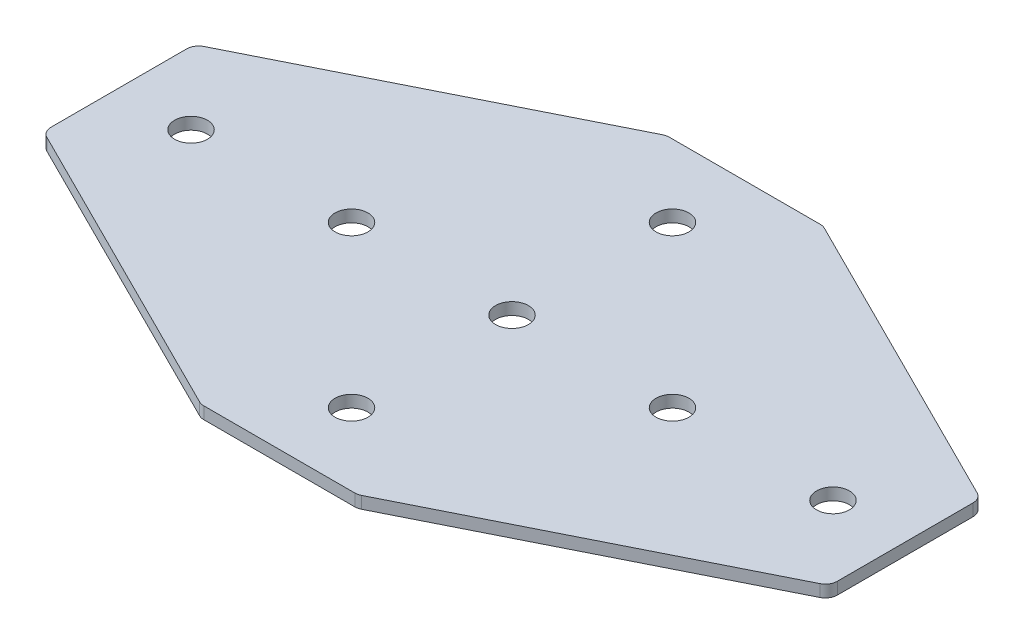
ISO-10303-21;
HEADER;
FILE_DESCRIPTION(('STEP AP214'),'2;1');
FILE_NAME('part.step','',(''),(''),'','','');
FILE_SCHEMA(('AUTOMOTIVE_DESIGN { 1 0 10303 214 1 1 1 1 }'));
ENDSEC;
DATA;
#1=APPLICATION_CONTEXT('core data for automotive mechanical design processes');
#2=APPLICATION_PROTOCOL_DEFINITION('international standard','automotive_design',2000,#1);
#3=PRODUCT_CONTEXT('',#1,'mechanical');
#4=PRODUCT('Part','Part','',(#3));
#5=PRODUCT_RELATED_PRODUCT_CATEGORY('part','',(#4));
#6=PRODUCT_DEFINITION_FORMATION('','',#4);
#7=PRODUCT_DEFINITION_CONTEXT('part definition',#1,'design');
#8=PRODUCT_DEFINITION('design','',#6,#7);
#9=PRODUCT_DEFINITION_SHAPE('','',#8);
#10=(LENGTH_UNIT() NAMED_UNIT(*) SI_UNIT(.MILLI.,.METRE.));
#11=(NAMED_UNIT(*) PLANE_ANGLE_UNIT() SI_UNIT($,.RADIAN.));
#12=(NAMED_UNIT(*) SI_UNIT($,.STERADIAN.) SOLID_ANGLE_UNIT());
#13=UNCERTAINTY_MEASURE_WITH_UNIT(LENGTH_MEASURE(1.E-05),#10,'distance_accuracy_value','');
#14=(GEOMETRIC_REPRESENTATION_CONTEXT(3) GLOBAL_UNCERTAINTY_ASSIGNED_CONTEXT((#13)) GLOBAL_UNIT_ASSIGNED_CONTEXT((#10,
#11,#12)) REPRESENTATION_CONTEXT('',''));
#15=CARTESIAN_POINT('',(0.,0.,0.));
#16=DIRECTION('',(0.,0.,1.));
#17=DIRECTION('',(1.,0.,0.));
#18=AXIS2_PLACEMENT_3D('',#15,#16,#17);
#19=CARTESIAN_POINT('',(-1.34521083117534,0.991348310286412,-1.14573259799045));
#20=DIRECTION('',(0.,-1.,0.));
#21=DIRECTION('',(0.,0.,-1.));
#22=AXIS2_PLACEMENT_3D('',#19,#20,#21);
#23=PLANE('',#22);
#24=CARTESIAN_POINT('',(-41.3452108311753,0.991348310286412,-1.14573259799042));
#25=DIRECTION('',(0.,-1.,0.));
#26=DIRECTION('',(0.,0.,1.));
#27=AXIS2_PLACEMENT_3D('',#24,#25,#26);
#28=CIRCLE('',#27,4.1);
#29=CARTESIAN_POINT('',(-41.3452108311753,0.991348310286412,2.95426740200958));
#30=VERTEX_POINT('',#29);
#31=EDGE_CURVE('E140',#30,#30,#28,.T.);
#32=ORIENTED_EDGE('',*,*,#31,.F.);
#33=EDGE_LOOP('',(#32));
#34=FACE_BOUND('',#33,.T.);
#35=CARTESIAN_POINT('',(-81.3452108311753,0.991348310286412,-1.14573259799042));
#36=DIRECTION('',(0.,-1.,0.));
#37=DIRECTION('',(0.,0.,1.));
#38=AXIS2_PLACEMENT_3D('',#35,#36,#37);
#39=CIRCLE('',#38,4.1);
#40=CARTESIAN_POINT('',(-81.3452108311753,0.991348310286412,2.95426740200958));
#41=VERTEX_POINT('',#40);
#42=EDGE_CURVE('E213',#41,#41,#39,.T.);
#43=ORIENTED_EDGE('',*,*,#42,.F.);
#44=EDGE_LOOP('',(#43));
#45=FACE_BOUND('',#44,.T.);
#46=CARTESIAN_POINT('',(-1.34521083117534,0.991348310286412,-1.14573259799045));
#47=DIRECTION('',(0.,1.,0.));
#48=DIRECTION('',(0.,0.,1.));
#49=AXIS2_PLACEMENT_3D('',#46,#47,#48);
#50=CIRCLE('',#49,4.1);
#51=CARTESIAN_POINT('',(-1.34521083117534,0.991348310286412,2.95426740200955));
#52=VERTEX_POINT('',#51);
#53=EDGE_CURVE('E268',#52,#52,#50,.T.);
#54=ORIENTED_EDGE('',*,*,#53,.T.);
#55=EDGE_LOOP('',(#54));
#56=FACE_BOUND('',#55,.T.);
#57=CARTESIAN_POINT('',(93.6547891688247,0.991348310286412,-18.0555626542409));
#58=DIRECTION('',(0.,1.,0.));
#59=DIRECTION('',(0.,0.,1.));
#60=AXIS2_PLACEMENT_3D('',#57,#58,#59);
#61=CIRCLE('',#60,3.);
#62=CARTESIAN_POINT('',(96.6547891688247,0.991348310286412,-18.0555626542409));
#63=VERTEX_POINT('',#62);
#64=CARTESIAN_POINT('',(94.9964299553245,0.991348310286412,-20.7388442272407));
#65=VERTEX_POINT('',#64);
#66=EDGE_CURVE('E199',#63,#65,#61,.T.);
#67=ORIENTED_EDGE('',*,*,#66,.F.);
#68=DIRECTION('',(0.,0.,-1.));
#69=VECTOR('',#68,1.);
#70=CARTESIAN_POINT('',(96.6547891688247,0.991348310286412,17.6181994245097));
#71=LINE('',#70,#69);
#72=CARTESIAN_POINT('',(96.6547891688247,0.991348310286412,15.7640974582601));
#73=VERTEX_POINT('',#72);
#74=EDGE_CURVE('E274',#73,#63,#71,.T.);
#75=ORIENTED_EDGE('',*,*,#74,.F.);
#76=CARTESIAN_POINT('',(93.6547891688247,0.991348310286412,15.7640974582601));
#77=DIRECTION('',(0.,-1.,0.));
#78=DIRECTION('',(0.,0.,-1.));
#79=AXIS2_PLACEMENT_3D('',#76,#77,#78);
#80=CIRCLE('',#79,3.);
#81=CARTESIAN_POINT('',(94.9964299553245,0.991348310286412,18.4473790312598));
#82=VERTEX_POINT('',#81);
#83=EDGE_CURVE('E31',#73,#82,#80,.T.);
#84=ORIENTED_EDGE('',*,*,#83,.T.);
#85=DIRECTION('',(0.894427190999916,0.,-0.447213595499958));
#86=VECTOR('',#85,1.);
#87=CARTESIAN_POINT('',(18.182653213825,0.991348310286412,56.8542674020095));
#88=LINE('',#87,#86);
#89=CARTESIAN_POINT('',(18.8160900678255,0.991348310286412,56.5375489750093));
#90=VERTEX_POINT('',#89);
#91=EDGE_CURVE('E279',#90,#82,#88,.T.);
#92=ORIENTED_EDGE('',*,*,#91,.F.);
#93=CARTESIAN_POINT('',(17.4744492813257,0.991348310286412,53.8542674020095));
#94=DIRECTION('',(0.,-1.,0.));
#95=DIRECTION('',(0.,0.,-1.));
#96=AXIS2_PLACEMENT_3D('',#93,#94,#95);
#97=CIRCLE('',#96,3.);
#98=CARTESIAN_POINT('',(17.4744492813257,0.991348310286412,56.8542674020095));
#99=VERTEX_POINT('',#98);
#100=EDGE_CURVE('E294',#90,#99,#97,.T.);
#101=ORIENTED_EDGE('',*,*,#100,.T.);
#102=DIRECTION('',(1.,0.,0.));
#103=VECTOR('',#102,1.);
#104=CARTESIAN_POINT('',(-19.3452108311753,0.991348310286412,56.8542674020095));
#105=LINE('',#104,#103);
#106=CARTESIAN_POINT('',(-20.1648709436763,0.991348310286412,56.8542674020096));
#107=VERTEX_POINT('',#106);
#108=EDGE_CURVE('E276',#107,#99,#105,.T.);
#109=ORIENTED_EDGE('',*,*,#108,.F.);
#110=CARTESIAN_POINT('',(-20.1648709436763,0.991348310286412,53.8542674020096));
#111=DIRECTION('',(0.,1.,0.));
#112=DIRECTION('',(0.,0.,-1.));
#113=AXIS2_PLACEMENT_3D('',#110,#111,#112);
#114=CIRCLE('',#113,3.);
#115=CARTESIAN_POINT('',(-21.5065117301762,0.991348310286412,56.5375489750093));
#116=VERTEX_POINT('',#115);
#117=EDGE_CURVE('E240',#116,#107,#114,.T.);
#118=ORIENTED_EDGE('',*,*,#117,.F.);
#119=DIRECTION('',(-0.894427190999916,0.,-0.447213595499958));
#120=VECTOR('',#119,1.);
#121=CARTESIAN_POINT('',(-20.8730748761757,0.991348310286412,56.8542674020096));
#122=LINE('',#121,#120);
#123=CARTESIAN_POINT('',(-97.6868516176752,0.991348310286412,18.4473790312598));
#124=VERTEX_POINT('',#123);
#125=EDGE_CURVE('E225',#116,#124,#122,.T.);
#126=ORIENTED_EDGE('',*,*,#125,.T.);
#127=CARTESIAN_POINT('',(-96.3452108311753,0.991348310286412,15.7640974582601));
#128=DIRECTION('',(0.,1.,0.));
#129=DIRECTION('',(0.,0.,-1.));
#130=AXIS2_PLACEMENT_3D('',#127,#128,#129);
#131=CIRCLE('',#130,3.);
#132=CARTESIAN_POINT('',(-99.3452108311753,0.991348310286412,15.7640974582601));
#133=VERTEX_POINT('',#132);
#134=EDGE_CURVE('E237',#133,#124,#131,.T.);
#135=ORIENTED_EDGE('',*,*,#134,.F.);
#136=DIRECTION('',(0.,0.,-1.));
#137=VECTOR('',#136,1.);
#138=CARTESIAN_POINT('',(-99.3452108311753,0.991348310286412,17.6181994245098));
#139=LINE('',#138,#137);
#140=CARTESIAN_POINT('',(-99.3452108311753,0.991348310286412,-18.055562654241));
#141=VERTEX_POINT('',#140);
#142=EDGE_CURVE('E223',#133,#141,#139,.T.);
#143=ORIENTED_EDGE('',*,*,#142,.T.);
#144=CARTESIAN_POINT('',(-96.3452108311753,0.991348310286412,-18.055562654241));
#145=DIRECTION('',(0.,-1.,0.));
#146=DIRECTION('',(0.,0.,1.));
#147=AXIS2_PLACEMENT_3D('',#144,#145,#146);
#148=CIRCLE('',#147,3.);
#149=CARTESIAN_POINT('',(-97.6868516176752,0.991348310286412,-20.7388442272407));
#150=VERTEX_POINT('',#149);
#151=EDGE_CURVE('E148',#141,#150,#148,.T.);
#152=ORIENTED_EDGE('',*,*,#151,.T.);
#153=DIRECTION('',(-0.894427190999916,0.,0.447213595499958));
#154=VECTOR('',#153,1.);
#155=CARTESIAN_POINT('',(-20.8730748761757,0.991348310286412,-59.1457325979904));
#156=LINE('',#155,#154);
#157=CARTESIAN_POINT('',(-21.5065117301762,0.991348310286412,-58.8290141709902));
#158=VERTEX_POINT('',#157);
#159=EDGE_CURVE('E158',#158,#150,#156,.T.);
#160=ORIENTED_EDGE('',*,*,#159,.F.);
#161=CARTESIAN_POINT('',(-20.1648709436763,0.991348310286412,-56.1457325979904));
#162=DIRECTION('',(0.,-1.,0.));
#163=DIRECTION('',(0.,0.,1.));
#164=AXIS2_PLACEMENT_3D('',#161,#162,#163);
#165=CIRCLE('',#164,3.);
#166=CARTESIAN_POINT('',(-20.1648709436763,0.991348310286412,-59.1457325979904));
#167=VERTEX_POINT('',#166);
#168=EDGE_CURVE('E168',#158,#167,#165,.T.);
#169=ORIENTED_EDGE('',*,*,#168,.T.);
#170=DIRECTION('',(1.,0.,0.));
#171=VECTOR('',#170,1.);
#172=CARTESIAN_POINT('',(-19.3452108311753,0.991348310286412,-59.1457325979904));
#173=LINE('',#172,#171);
#174=CARTESIAN_POINT('',(17.4744492813257,0.991348310286412,-59.1457325979904));
#175=VERTEX_POINT('',#174);
#176=EDGE_CURVE('E180',#167,#175,#173,.T.);
#177=ORIENTED_EDGE('',*,*,#176,.T.);
#178=CARTESIAN_POINT('',(17.4744492813257,0.991348310286412,-56.1457325979904));
#179=DIRECTION('',(0.,1.,0.));
#180=DIRECTION('',(0.,0.,1.));
#181=AXIS2_PLACEMENT_3D('',#178,#179,#180);
#182=CIRCLE('',#181,3.);
#183=CARTESIAN_POINT('',(18.8160900678255,0.991348310286412,-58.8290141709902));
#184=VERTEX_POINT('',#183);
#185=EDGE_CURVE('E202',#184,#175,#182,.T.);
#186=ORIENTED_EDGE('',*,*,#185,.F.);
#187=DIRECTION('',(0.894427190999916,0.,0.447213595499958));
#188=VECTOR('',#187,1.);
#189=CARTESIAN_POINT('',(18.182653213825,0.991348310286412,-59.1457325979904));
#190=LINE('',#189,#188);
#191=EDGE_CURVE('E183',#184,#65,#190,.T.);
#192=ORIENTED_EDGE('',*,*,#191,.T.);
#193=EDGE_LOOP('',(#67,#75,#84,#92,#101,#109,#118,#126,#135,#143,#152,#160,#169,#177,#186,#192));
#194=FACE_BOUND('',#193,.T.);
#195=CARTESIAN_POINT('',(78.6547891688247,0.991348310286412,-1.14573259799045));
#196=DIRECTION('',(0.,1.,0.));
#197=DIRECTION('',(0.,0.,1.));
#198=AXIS2_PLACEMENT_3D('',#195,#196,#197);
#199=CIRCLE('',#198,4.1);
#200=CARTESIAN_POINT('',(78.6547891688247,0.991348310286412,2.95426740200956));
#201=VERTEX_POINT('',#200);
#202=EDGE_CURVE('E250',#201,#201,#199,.T.);
#203=ORIENTED_EDGE('',*,*,#202,.T.);
#204=EDGE_LOOP('',(#203));
#205=FACE_BOUND('',#204,.T.);
#206=CARTESIAN_POINT('',(-1.34521083117535,0.991348310286412,38.8542674020096));
#207=DIRECTION('',(0.,1.,0.));
#208=DIRECTION('',(0.,0.,1.));
#209=AXIS2_PLACEMENT_3D('',#206,#207,#208);
#210=CIRCLE('',#209,4.1);
#211=CARTESIAN_POINT('',(-1.34521083117535,0.991348310286412,42.9542674020096));
#212=VERTEX_POINT('',#211);
#213=EDGE_CURVE('E256',#212,#212,#210,.T.);
#214=ORIENTED_EDGE('',*,*,#213,.T.);
#215=EDGE_LOOP('',(#214));
#216=FACE_BOUND('',#215,.T.);
#217=CARTESIAN_POINT('',(38.6547891688247,0.991348310286412,-1.14573259799043));
#218=DIRECTION('',(0.,1.,0.));
#219=DIRECTION('',(0.,0.,1.));
#220=AXIS2_PLACEMENT_3D('',#217,#218,#219);
#221=CIRCLE('',#220,4.1);
#222=CARTESIAN_POINT('',(38.6547891688247,0.991348310286412,2.95426740200957));
#223=VERTEX_POINT('',#222);
#224=EDGE_CURVE('E262',#223,#223,#221,.T.);
#225=ORIENTED_EDGE('',*,*,#224,.T.);
#226=EDGE_LOOP('',(#225));
#227=FACE_BOUND('',#226,.T.);
#228=CARTESIAN_POINT('',(-1.34521083117535,0.991348310286412,-41.1457325979905));
#229=DIRECTION('',(0.,-1.,0.));
#230=DIRECTION('',(0.,0.,-1.));
#231=AXIS2_PLACEMENT_3D('',#228,#229,#230);
#232=CIRCLE('',#231,4.1);
#233=CARTESIAN_POINT('',(-1.34521083117535,0.991348310286412,-45.2457325979905));
#234=VERTEX_POINT('',#233);
#235=EDGE_CURVE('E174',#234,#234,#232,.T.);
#236=ORIENTED_EDGE('',*,*,#235,.F.);
#237=EDGE_LOOP('',(#236));
#238=FACE_BOUND('',#237,.T.);
#239=ADVANCED_FACE('F16',(#34,#45,#56,#194,#205,#216,#227,#238),#23,.T.);
#240=CARTESIAN_POINT('',(96.6547891688247,0.991348310286412,17.6181994245097));
#241=DIRECTION('',(1.,0.,0.));
#242=DIRECTION('',(0.,0.,-1.));
#243=AXIS2_PLACEMENT_3D('',#240,#241,#242);
#244=PLANE('',#243);
#245=ORIENTED_EDGE('',*,*,#74,.T.);
#246=DIRECTION('',(0.,1.,0.));
#247=VECTOR('',#246,1.);
#248=CARTESIAN_POINT('',(96.6547891688247,0.991348310286412,-18.0555626542409));
#249=LINE('',#248,#247);
#250=CARTESIAN_POINT('',(96.6547891688247,3.99134831028641,-18.0555626542409));
#251=VERTEX_POINT('',#250);
#252=EDGE_CURVE('E209',#251,#63,#249,.F.);
#253=ORIENTED_EDGE('',*,*,#252,.F.);
#254=DIRECTION('',(0.,0.,-1.));
#255=VECTOR('',#254,1.);
#256=CARTESIAN_POINT('',(96.6547891688247,3.99134831028641,17.6181994245097));
#257=LINE('',#256,#255);
#258=CARTESIAN_POINT('',(96.6547891688247,3.99134831028641,15.7640974582601));
#259=VERTEX_POINT('',#258);
#260=EDGE_CURVE('E271',#259,#251,#257,.T.);
#261=ORIENTED_EDGE('',*,*,#260,.F.);
#262=DIRECTION('',(0.,1.,0.));
#263=VECTOR('',#262,1.);
#264=CARTESIAN_POINT('',(96.6547891688247,0.991348310286412,15.7640974582601));
#265=LINE('',#264,#263);
#266=EDGE_CURVE('E10',#259,#73,#265,.F.);
#267=ORIENTED_EDGE('',*,*,#266,.T.);
#268=EDGE_LOOP('',(#245,#253,#261,#267));
#269=FACE_BOUND('',#268,.T.);
#270=ADVANCED_FACE('F316',(#269),#244,.T.);
#271=CARTESIAN_POINT('',(-1.34521083117534,3.99134831028641,-1.14573259799045));
#272=DIRECTION('',(0.,-1.,0.));
#273=DIRECTION('',(0.,0.,-1.));
#274=AXIS2_PLACEMENT_3D('',#271,#272,#273);
#275=PLANE('',#274);
#276=CARTESIAN_POINT('',(-41.3452108311753,3.99134831028641,-1.14573259799042));
#277=DIRECTION('',(0.,-1.,0.));
#278=DIRECTION('',(0.,0.,1.));
#279=AXIS2_PLACEMENT_3D('',#276,#277,#278);
#280=CIRCLE('',#279,4.1);
#281=CARTESIAN_POINT('',(-41.3452108311753,3.99134831028641,2.95426740200958));
#282=VERTEX_POINT('',#281);
#283=EDGE_CURVE('E216',#282,#282,#280,.T.);
#284=ORIENTED_EDGE('',*,*,#283,.T.);
#285=EDGE_LOOP('',(#284));
#286=FACE_BOUND('',#285,.T.);
#287=CARTESIAN_POINT('',(-81.3452108311753,3.99134831028641,-1.14573259799042));
#288=DIRECTION('',(0.,-1.,0.));
#289=DIRECTION('',(0.,0.,1.));
#290=AXIS2_PLACEMENT_3D('',#287,#288,#289);
#291=CIRCLE('',#290,4.1);
#292=CARTESIAN_POINT('',(-81.3452108311753,3.99134831028641,2.95426740200958));
#293=VERTEX_POINT('',#292);
#294=EDGE_CURVE('E212',#293,#293,#291,.T.);
#295=ORIENTED_EDGE('',*,*,#294,.T.);
#296=EDGE_LOOP('',(#295));
#297=FACE_BOUND('',#296,.T.);
#298=CARTESIAN_POINT('',(-1.34521083117534,3.99134831028641,-1.14573259799045));
#299=DIRECTION('',(0.,1.,0.));
#300=DIRECTION('',(0.,0.,1.));
#301=AXIS2_PLACEMENT_3D('',#298,#299,#300);
#302=CIRCLE('',#301,4.1);
#303=CARTESIAN_POINT('',(-1.34521083117534,3.99134831028641,2.95426740200955));
#304=VERTEX_POINT('',#303);
#305=EDGE_CURVE('E265',#304,#304,#302,.T.);
#306=ORIENTED_EDGE('',*,*,#305,.F.);
#307=EDGE_LOOP('',(#306));
#308=FACE_BOUND('',#307,.T.);
#309=ORIENTED_EDGE('',*,*,#260,.T.);
#310=CARTESIAN_POINT('',(93.6547891688247,3.99134831028641,-18.0555626542409));
#311=DIRECTION('',(0.,1.,0.));
#312=DIRECTION('',(0.,0.,1.));
#313=AXIS2_PLACEMENT_3D('',#310,#311,#312);
#314=CIRCLE('',#313,3.);
#315=CARTESIAN_POINT('',(94.9964299553245,3.99134831028641,-20.7388442272407));
#316=VERTEX_POINT('',#315);
#317=EDGE_CURVE('E187',#316,#251,#314,.F.);
#318=ORIENTED_EDGE('',*,*,#317,.F.);
#319=DIRECTION('',(0.894427190999916,0.,0.447213595499958));
#320=VECTOR('',#319,1.);
#321=CARTESIAN_POINT('',(18.182653213825,3.99134831028641,-59.1457325979904));
#322=LINE('',#321,#320);
#323=CARTESIAN_POINT('',(18.8160900678255,3.99134831028641,-58.8290141709902));
#324=VERTEX_POINT('',#323);
#325=EDGE_CURVE('E184',#324,#316,#322,.T.);
#326=ORIENTED_EDGE('',*,*,#325,.F.);
#327=CARTESIAN_POINT('',(17.4744492813257,3.99134831028641,-56.1457325979904));
#328=DIRECTION('',(0.,1.,0.));
#329=DIRECTION('',(0.,0.,1.));
#330=AXIS2_PLACEMENT_3D('',#327,#328,#329);
#331=CIRCLE('',#330,3.);
#332=CARTESIAN_POINT('',(17.4744492813257,3.99134831028641,-59.1457325979904));
#333=VERTEX_POINT('',#332);
#334=EDGE_CURVE('E194',#333,#324,#331,.F.);
#335=ORIENTED_EDGE('',*,*,#334,.F.);
#336=DIRECTION('',(1.,0.,0.));
#337=VECTOR('',#336,1.);
#338=CARTESIAN_POINT('',(-19.3452108311753,3.99134831028641,-59.1457325979904));
#339=LINE('',#338,#337);
#340=CARTESIAN_POINT('',(-20.1648709436763,3.99134831028641,-59.1457325979904));
#341=VERTEX_POINT('',#340);
#342=EDGE_CURVE('E177',#341,#333,#339,.T.);
#343=ORIENTED_EDGE('',*,*,#342,.F.);
#344=CARTESIAN_POINT('',(-20.1648709436763,3.99134831028641,-56.1457325979904));
#345=DIRECTION('',(0.,-1.,0.));
#346=DIRECTION('',(0.,0.,1.));
#347=AXIS2_PLACEMENT_3D('',#344,#345,#346);
#348=CIRCLE('',#347,3.);
#349=CARTESIAN_POINT('',(-21.5065117301762,3.99134831028641,-58.8290141709902));
#350=VERTEX_POINT('',#349);
#351=EDGE_CURVE('E157',#341,#350,#348,.F.);
#352=ORIENTED_EDGE('',*,*,#351,.T.);
#353=DIRECTION('',(-0.894427190999916,0.,0.447213595499958));
#354=VECTOR('',#353,1.);
#355=CARTESIAN_POINT('',(-20.8730748761757,3.99134831028641,-59.1457325979904));
#356=LINE('',#355,#354);
#357=CARTESIAN_POINT('',(-97.6868516176752,3.99134831028641,-20.7388442272407));
#358=VERTEX_POINT('',#357);
#359=EDGE_CURVE('E156',#350,#358,#356,.T.);
#360=ORIENTED_EDGE('',*,*,#359,.T.);
#361=CARTESIAN_POINT('',(-96.3452108311753,3.99134831028641,-18.055562654241));
#362=DIRECTION('',(0.,-1.,0.));
#363=DIRECTION('',(0.,0.,1.));
#364=AXIS2_PLACEMENT_3D('',#361,#362,#363);
#365=CIRCLE('',#364,3.);
#366=CARTESIAN_POINT('',(-99.3452108311753,3.99134831028641,-18.055562654241));
#367=VERTEX_POINT('',#366);
#368=EDGE_CURVE('E145',#358,#367,#365,.F.);
#369=ORIENTED_EDGE('',*,*,#368,.T.);
#370=DIRECTION('',(0.,0.,-1.));
#371=VECTOR('',#370,1.);
#372=CARTESIAN_POINT('',(-99.3452108311753,3.99134831028641,17.6181994245098));
#373=LINE('',#372,#371);
#374=CARTESIAN_POINT('',(-99.3452108311753,3.99134831028641,15.7640974582601));
#375=VERTEX_POINT('',#374);
#376=EDGE_CURVE('E130',#375,#367,#373,.T.);
#377=ORIENTED_EDGE('',*,*,#376,.F.);
#378=CARTESIAN_POINT('',(-96.3452108311753,3.99134831028641,15.7640974582601));
#379=DIRECTION('',(0.,1.,0.));
#380=DIRECTION('',(0.,0.,-1.));
#381=AXIS2_PLACEMENT_3D('',#378,#379,#380);
#382=CIRCLE('',#381,3.);
#383=CARTESIAN_POINT('',(-97.6868516176752,3.99134831028641,18.4473790312598));
#384=VERTEX_POINT('',#383);
#385=EDGE_CURVE('E227',#384,#375,#382,.F.);
#386=ORIENTED_EDGE('',*,*,#385,.F.);
#387=DIRECTION('',(-0.894427190999916,0.,-0.447213595499958));
#388=VECTOR('',#387,1.);
#389=CARTESIAN_POINT('',(-20.8730748761757,3.99134831028641,56.8542674020096));
#390=LINE('',#389,#388);
#391=CARTESIAN_POINT('',(-21.5065117301762,3.99134831028641,56.5375489750093));
#392=VERTEX_POINT('',#391);
#393=EDGE_CURVE('E139',#392,#384,#390,.T.);
#394=ORIENTED_EDGE('',*,*,#393,.F.);
#395=CARTESIAN_POINT('',(-20.1648709436763,3.99134831028641,53.8542674020096));
#396=DIRECTION('',(0.,1.,0.));
#397=DIRECTION('',(0.,0.,-1.));
#398=AXIS2_PLACEMENT_3D('',#395,#396,#397);
#399=CIRCLE('',#398,3.);
#400=CARTESIAN_POINT('',(-20.1648709436763,3.99134831028641,56.8542674020096));
#401=VERTEX_POINT('',#400);
#402=EDGE_CURVE('E232',#401,#392,#399,.F.);
#403=ORIENTED_EDGE('',*,*,#402,.F.);
#404=DIRECTION('',(1.,0.,0.));
#405=VECTOR('',#404,1.);
#406=CARTESIAN_POINT('',(-19.3452108311753,3.99134831028641,56.8542674020095));
#407=LINE('',#406,#405);
#408=CARTESIAN_POINT('',(17.4744492813257,3.99134831028641,56.8542674020095));
#409=VERTEX_POINT('',#408);
#410=EDGE_CURVE('E283',#401,#409,#407,.T.);
#411=ORIENTED_EDGE('',*,*,#410,.T.);
#412=CARTESIAN_POINT('',(17.4744492813257,3.99134831028641,53.8542674020095));
#413=DIRECTION('',(0.,-1.,0.));
#414=DIRECTION('',(0.,0.,-1.));
#415=AXIS2_PLACEMENT_3D('',#412,#413,#414);
#416=CIRCLE('',#415,3.);
#417=CARTESIAN_POINT('',(18.8160900678255,3.99134831028641,56.5375489750093));
#418=VERTEX_POINT('',#417);
#419=EDGE_CURVE('E288',#409,#418,#416,.F.);
#420=ORIENTED_EDGE('',*,*,#419,.T.);
#421=DIRECTION('',(0.894427190999916,0.,-0.447213595499958));
#422=VECTOR('',#421,1.);
#423=CARTESIAN_POINT('',(18.182653213825,3.99134831028641,56.8542674020095));
#424=LINE('',#423,#422);
#425=CARTESIAN_POINT('',(94.9964299553245,3.99134831028641,18.4473790312598));
#426=VERTEX_POINT('',#425);
#427=EDGE_CURVE('E277',#418,#426,#424,.T.);
#428=ORIENTED_EDGE('',*,*,#427,.T.);
#429=CARTESIAN_POINT('',(93.6547891688247,3.99134831028641,15.7640974582601));
#430=DIRECTION('',(0.,-1.,0.));
#431=DIRECTION('',(0.,0.,-1.));
#432=AXIS2_PLACEMENT_3D('',#429,#430,#431);
#433=CIRCLE('',#432,3.);
#434=EDGE_CURVE('E281',#426,#259,#433,.F.);
#435=ORIENTED_EDGE('',*,*,#434,.T.);
#436=EDGE_LOOP('',(#309,#318,#326,#335,#343,#352,#360,#369,#377,#386,#394,#403,#411,#420,#428,#435));
#437=FACE_BOUND('',#436,.T.);
#438=CARTESIAN_POINT('',(78.6547891688247,3.99134831028641,-1.14573259799045));
#439=DIRECTION('',(0.,1.,0.));
#440=DIRECTION('',(0.,0.,1.));
#441=AXIS2_PLACEMENT_3D('',#438,#439,#440);
#442=CIRCLE('',#441,4.1);
#443=CARTESIAN_POINT('',(78.6547891688247,3.99134831028641,2.95426740200956));
#444=VERTEX_POINT('',#443);
#445=EDGE_CURVE('E249',#444,#444,#442,.T.);
#446=ORIENTED_EDGE('',*,*,#445,.F.);
#447=EDGE_LOOP('',(#446));
#448=FACE_BOUND('',#447,.T.);
#449=CARTESIAN_POINT('',(-1.34521083117535,3.99134831028641,38.8542674020096));
#450=DIRECTION('',(0.,1.,0.));
#451=DIRECTION('',(0.,0.,1.));
#452=AXIS2_PLACEMENT_3D('',#449,#450,#451);
#453=CIRCLE('',#452,4.1);
#454=CARTESIAN_POINT('',(-1.34521083117535,3.99134831028641,42.9542674020096));
#455=VERTEX_POINT('',#454);
#456=EDGE_CURVE('E253',#455,#455,#453,.T.);
#457=ORIENTED_EDGE('',*,*,#456,.F.);
#458=EDGE_LOOP('',(#457));
#459=FACE_BOUND('',#458,.T.);
#460=CARTESIAN_POINT('',(38.6547891688247,3.99134831028641,-1.14573259799043));
#461=DIRECTION('',(0.,1.,0.));
#462=DIRECTION('',(0.,0.,1.));
#463=AXIS2_PLACEMENT_3D('',#460,#461,#462);
#464=CIRCLE('',#463,4.1);
#465=CARTESIAN_POINT('',(38.6547891688247,3.99134831028641,2.95426740200957));
#466=VERTEX_POINT('',#465);
#467=EDGE_CURVE('E259',#466,#466,#464,.T.);
#468=ORIENTED_EDGE('',*,*,#467,.F.);
#469=EDGE_LOOP('',(#468));
#470=FACE_BOUND('',#469,.T.);
#471=CARTESIAN_POINT('',(-1.34521083117535,3.99134831028641,-41.1457325979905));
#472=DIRECTION('',(0.,-1.,0.));
#473=DIRECTION('',(0.,0.,-1.));
#474=AXIS2_PLACEMENT_3D('',#471,#472,#473);
#475=CIRCLE('',#474,4.1);
#476=CARTESIAN_POINT('',(-1.34521083117535,3.99134831028641,-45.2457325979905));
#477=VERTEX_POINT('',#476);
#478=EDGE_CURVE('E149',#477,#477,#475,.T.);
#479=ORIENTED_EDGE('',*,*,#478,.T.);
#480=EDGE_LOOP('',(#479));
#481=FACE_BOUND('',#480,.T.);
#482=ADVANCED_FACE('F152',(#286,#297,#308,#437,#448,#459,#470,#481),#275,.F.);
#483=CARTESIAN_POINT('',(-1.34521083117534,0.991348310286412,-1.14573259799045));
#484=DIRECTION('',(0.,1.,0.));
#485=DIRECTION('',(0.,0.,1.));
#486=AXIS2_PLACEMENT_3D('',#483,#484,#485);
#487=CYLINDRICAL_SURFACE('',#486,4.1);
#488=ORIENTED_EDGE('',*,*,#53,.F.);
#489=EDGE_LOOP('',(#488));
#490=FACE_BOUND('',#489,.T.);
#491=ORIENTED_EDGE('',*,*,#305,.T.);
#492=EDGE_LOOP('',(#491));
#493=FACE_BOUND('',#492,.T.);
#494=ADVANCED_FACE('F392',(#490,#493),#487,.F.);
#495=CARTESIAN_POINT('',(38.6547891688247,0.991348310286412,-1.14573259799043));
#496=DIRECTION('',(0.,1.,0.));
#497=DIRECTION('',(0.,0.,1.));
#498=AXIS2_PLACEMENT_3D('',#495,#496,#497);
#499=CYLINDRICAL_SURFACE('',#498,4.1);
#500=ORIENTED_EDGE('',*,*,#467,.T.);
#501=EDGE_LOOP('',(#500));
#502=FACE_BOUND('',#501,.T.);
#503=ORIENTED_EDGE('',*,*,#224,.F.);
#504=EDGE_LOOP('',(#503));
#505=FACE_BOUND('',#504,.T.);
#506=ADVANCED_FACE('F385',(#502,#505),#499,.F.);
#507=CARTESIAN_POINT('',(78.6547891688247,0.991348310286412,-1.14573259799045));
#508=DIRECTION('',(0.,1.,0.));
#509=DIRECTION('',(0.,0.,1.));
#510=AXIS2_PLACEMENT_3D('',#507,#508,#509);
#511=CYLINDRICAL_SURFACE('',#510,4.1);
#512=ORIENTED_EDGE('',*,*,#445,.T.);
#513=EDGE_LOOP('',(#512));
#514=FACE_BOUND('',#513,.T.);
#515=ORIENTED_EDGE('',*,*,#202,.F.);
#516=EDGE_LOOP('',(#515));
#517=FACE_BOUND('',#516,.T.);
#518=ADVANCED_FACE('F376',(#514,#517),#511,.F.);
#519=CARTESIAN_POINT('',(-99.3452108311753,0.991348310286412,17.6181994245098));
#520=DIRECTION('',(-1.,0.,0.));
#521=DIRECTION('',(0.,0.,-1.));
#522=AXIS2_PLACEMENT_3D('',#519,#520,#521);
#523=PLANE('',#522);
#524=ORIENTED_EDGE('',*,*,#376,.T.);
#525=DIRECTION('',(0.,1.,0.));
#526=VECTOR('',#525,1.);
#527=CARTESIAN_POINT('',(-99.3452108311753,0.991348310286412,-18.055562654241));
#528=LINE('',#527,#526);
#529=EDGE_CURVE('E134',#367,#141,#528,.F.);
#530=ORIENTED_EDGE('',*,*,#529,.T.);
#531=ORIENTED_EDGE('',*,*,#142,.F.);
#532=DIRECTION('',(0.,1.,0.));
#533=VECTOR('',#532,1.);
#534=CARTESIAN_POINT('',(-99.3452108311753,0.991348310286412,15.7640974582601));
#535=LINE('',#534,#533);
#536=EDGE_CURVE('E136',#375,#133,#535,.F.);
#537=ORIENTED_EDGE('',*,*,#536,.F.);
#538=EDGE_LOOP('',(#524,#530,#531,#537));
#539=FACE_BOUND('',#538,.T.);
#540=ADVANCED_FACE('F132',(#539),#523,.T.);
#541=CARTESIAN_POINT('',(-41.3452108311753,0.991348310286412,-1.14573259799042));
#542=DIRECTION('',(0.,1.,0.));
#543=DIRECTION('',(0.,0.,1.));
#544=AXIS2_PLACEMENT_3D('',#541,#542,#543);
#545=CYLINDRICAL_SURFACE('',#544,4.1);
#546=ORIENTED_EDGE('',*,*,#31,.T.);
#547=EDGE_LOOP('',(#546));
#548=FACE_BOUND('',#547,.T.);
#549=ORIENTED_EDGE('',*,*,#283,.F.);
#550=EDGE_LOOP('',(#549));
#551=FACE_BOUND('',#550,.T.);
#552=ADVANCED_FACE('F363',(#548,#551),#545,.F.);
#553=CARTESIAN_POINT('',(-81.3452108311753,0.991348310286412,-1.14573259799042));
#554=DIRECTION('',(0.,1.,0.));
#555=DIRECTION('',(0.,0.,1.));
#556=AXIS2_PLACEMENT_3D('',#553,#554,#555);
#557=CYLINDRICAL_SURFACE('',#556,4.1);
#558=ORIENTED_EDGE('',*,*,#294,.F.);
#559=EDGE_LOOP('',(#558));
#560=FACE_BOUND('',#559,.T.);
#561=ORIENTED_EDGE('',*,*,#42,.T.);
#562=EDGE_LOOP('',(#561));
#563=FACE_BOUND('',#562,.T.);
#564=ADVANCED_FACE('F360',(#560,#563),#557,.F.);
#565=CARTESIAN_POINT('',(18.182653213825,0.991348310286412,56.8542674020095));
#566=DIRECTION('',(0.447213595499958,0.,0.894427190999916));
#567=DIRECTION('',(0.894427190999916,0.,-0.447213595499958));
#568=AXIS2_PLACEMENT_3D('',#565,#566,#567);
#569=PLANE('',#568);
#570=ORIENTED_EDGE('',*,*,#427,.F.);
#571=DIRECTION('',(0.,1.,0.));
#572=VECTOR('',#571,1.);
#573=CARTESIAN_POINT('',(18.8160900678255,0.991348310286412,56.5375489750093));
#574=LINE('',#573,#572);
#575=EDGE_CURVE('E24',#418,#90,#574,.F.);
#576=ORIENTED_EDGE('',*,*,#575,.T.);
#577=ORIENTED_EDGE('',*,*,#91,.T.);
#578=DIRECTION('',(0.,1.,0.));
#579=VECTOR('',#578,1.);
#580=CARTESIAN_POINT('',(94.9964299553246,0.991348310286412,18.4473790312598));
#581=LINE('',#580,#579);
#582=EDGE_CURVE('E297',#82,#426,#581,.T.);
#583=ORIENTED_EDGE('',*,*,#582,.T.);
#584=EDGE_LOOP('',(#570,#576,#577,#583));
#585=FACE_BOUND('',#584,.T.);
#586=ADVANCED_FACE('F300',(#585),#569,.T.);
#587=CARTESIAN_POINT('',(-19.3452108311753,0.991348310286412,56.8542674020095));
#588=DIRECTION('',(0.,0.,1.));
#589=DIRECTION('',(1.,0.,0.));
#590=AXIS2_PLACEMENT_3D('',#587,#588,#589);
#591=PLANE('',#590);
#592=ORIENTED_EDGE('',*,*,#410,.F.);
#593=DIRECTION('',(0.,1.,0.));
#594=VECTOR('',#593,1.);
#595=CARTESIAN_POINT('',(-20.1648709436763,0.991348310286412,56.8542674020096));
#596=LINE('',#595,#594);
#597=EDGE_CURVE('E234',#107,#401,#596,.T.);
#598=ORIENTED_EDGE('',*,*,#597,.F.);
#599=ORIENTED_EDGE('',*,*,#108,.T.);
#600=DIRECTION('',(0.,1.,0.));
#601=VECTOR('',#600,1.);
#602=CARTESIAN_POINT('',(17.4744492813257,0.991348310286412,56.8542674020095));
#603=LINE('',#602,#601);
#604=EDGE_CURVE('E290',#99,#409,#603,.T.);
#605=ORIENTED_EDGE('',*,*,#604,.T.);
#606=EDGE_LOOP('',(#592,#598,#599,#605));
#607=FACE_BOUND('',#606,.T.);
#608=ADVANCED_FACE('F310',(#607),#591,.T.);
#609=CARTESIAN_POINT('',(17.4744492813257,0.991348310286412,53.8542674020095));
#610=DIRECTION('',(0.,1.,0.));
#611=DIRECTION('',(0.,0.,1.));
#612=AXIS2_PLACEMENT_3D('',#609,#610,#611);
#613=CYLINDRICAL_SURFACE('',#612,3.);
#614=ORIENTED_EDGE('',*,*,#100,.F.);
#615=ORIENTED_EDGE('',*,*,#575,.F.);
#616=ORIENTED_EDGE('',*,*,#419,.F.);
#617=ORIENTED_EDGE('',*,*,#604,.F.);
#618=EDGE_LOOP('',(#614,#615,#616,#617));
#619=FACE_BOUND('',#618,.T.);
#620=ADVANCED_FACE('F308',(#619),#613,.T.);
#621=CARTESIAN_POINT('',(93.6547891688247,0.991348310286412,15.7640974582601));
#622=DIRECTION('',(0.,1.,0.));
#623=DIRECTION('',(0.,0.,1.));
#624=AXIS2_PLACEMENT_3D('',#621,#622,#623);
#625=CYLINDRICAL_SURFACE('',#624,3.);
#626=ORIENTED_EDGE('',*,*,#83,.F.);
#627=ORIENTED_EDGE('',*,*,#266,.F.);
#628=ORIENTED_EDGE('',*,*,#434,.F.);
#629=ORIENTED_EDGE('',*,*,#582,.F.);
#630=EDGE_LOOP('',(#626,#627,#628,#629));
#631=FACE_BOUND('',#630,.T.);
#632=ADVANCED_FACE('F18',(#631),#625,.T.);
#633=CARTESIAN_POINT('',(-1.34521083117535,0.991348310286412,38.8542674020096));
#634=DIRECTION('',(0.,1.,0.));
#635=DIRECTION('',(0.,0.,1.));
#636=AXIS2_PLACEMENT_3D('',#633,#634,#635);
#637=CYLINDRICAL_SURFACE('',#636,4.1);
#638=ORIENTED_EDGE('',*,*,#456,.T.);
#639=EDGE_LOOP('',(#638));
#640=FACE_BOUND('',#639,.T.);
#641=ORIENTED_EDGE('',*,*,#213,.F.);
#642=EDGE_LOOP('',(#641));
#643=FACE_BOUND('',#642,.T.);
#644=ADVANCED_FACE('F372',(#640,#643),#637,.F.);
#645=CARTESIAN_POINT('',(-20.8730748761757,0.991348310286412,56.8542674020096));
#646=DIRECTION('',(-0.447213595499958,0.,0.894427190999916));
#647=DIRECTION('',(-0.894427190999916,0.,-0.447213595499958));
#648=AXIS2_PLACEMENT_3D('',#645,#646,#647);
#649=PLANE('',#648);
#650=ORIENTED_EDGE('',*,*,#393,.T.);
#651=DIRECTION('',(0.,1.,0.));
#652=VECTOR('',#651,1.);
#653=CARTESIAN_POINT('',(-97.6868516176752,0.991348310286412,18.4473790312598));
#654=LINE('',#653,#652);
#655=EDGE_CURVE('E243',#124,#384,#654,.T.);
#656=ORIENTED_EDGE('',*,*,#655,.F.);
#657=ORIENTED_EDGE('',*,*,#125,.F.);
#658=DIRECTION('',(0.,1.,0.));
#659=VECTOR('',#658,1.);
#660=CARTESIAN_POINT('',(-21.5065117301762,0.991348310286412,56.5375489750093));
#661=LINE('',#660,#659);
#662=EDGE_CURVE('E246',#392,#116,#661,.F.);
#663=ORIENTED_EDGE('',*,*,#662,.F.);
#664=EDGE_LOOP('',(#650,#656,#657,#663));
#665=FACE_BOUND('',#664,.T.);
#666=ADVANCED_FACE('F368',(#665),#649,.T.);
#667=CARTESIAN_POINT('',(-20.1648709436763,0.991348310286412,53.8542674020096));
#668=DIRECTION('',(0.,1.,0.));
#669=DIRECTION('',(0.,0.,1.));
#670=AXIS2_PLACEMENT_3D('',#667,#668,#669);
#671=CYLINDRICAL_SURFACE('',#670,3.);
#672=ORIENTED_EDGE('',*,*,#117,.T.);
#673=ORIENTED_EDGE('',*,*,#597,.T.);
#674=ORIENTED_EDGE('',*,*,#402,.T.);
#675=ORIENTED_EDGE('',*,*,#662,.T.);
#676=EDGE_LOOP('',(#672,#673,#674,#675));
#677=FACE_BOUND('',#676,.T.);
#678=ADVANCED_FACE('F371',(#677),#671,.T.);
#679=CARTESIAN_POINT('',(-96.3452108311753,0.991348310286412,15.7640974582601));
#680=DIRECTION('',(0.,1.,0.));
#681=DIRECTION('',(0.,0.,1.));
#682=AXIS2_PLACEMENT_3D('',#679,#680,#681);
#683=CYLINDRICAL_SURFACE('',#682,3.);
#684=ORIENTED_EDGE('',*,*,#134,.T.);
#685=ORIENTED_EDGE('',*,*,#655,.T.);
#686=ORIENTED_EDGE('',*,*,#385,.T.);
#687=ORIENTED_EDGE('',*,*,#536,.T.);
#688=EDGE_LOOP('',(#684,#685,#686,#687));
#689=FACE_BOUND('',#688,.T.);
#690=ADVANCED_FACE('F352',(#689),#683,.T.);
#691=CARTESIAN_POINT('',(18.182653213825,0.991348310286412,-59.1457325979904));
#692=DIRECTION('',(0.447213595499958,0.,-0.894427190999916));
#693=DIRECTION('',(0.894427190999916,0.,0.447213595499958));
#694=AXIS2_PLACEMENT_3D('',#691,#692,#693);
#695=PLANE('',#694);
#696=ORIENTED_EDGE('',*,*,#325,.T.);
#697=DIRECTION('',(0.,1.,0.));
#698=VECTOR('',#697,1.);
#699=CARTESIAN_POINT('',(94.9964299553246,0.991348310286412,-20.7388442272407));
#700=LINE('',#699,#698);
#701=EDGE_CURVE('E205',#65,#316,#700,.T.);
#702=ORIENTED_EDGE('',*,*,#701,.F.);
#703=ORIENTED_EDGE('',*,*,#191,.F.);
#704=DIRECTION('',(0.,1.,0.));
#705=VECTOR('',#704,1.);
#706=CARTESIAN_POINT('',(18.8160900678255,0.991348310286412,-58.8290141709902));
#707=LINE('',#706,#705);
#708=EDGE_CURVE('E207',#324,#184,#707,.F.);
#709=ORIENTED_EDGE('',*,*,#708,.F.);
#710=EDGE_LOOP('',(#696,#702,#703,#709));
#711=FACE_BOUND('',#710,.T.);
#712=ADVANCED_FACE('F348',(#711),#695,.T.);
#713=CARTESIAN_POINT('',(-19.3452108311753,0.991348310286412,-59.1457325979904));
#714=DIRECTION('',(0.,0.,-1.));
#715=DIRECTION('',(1.,0.,0.));
#716=AXIS2_PLACEMENT_3D('',#713,#714,#715);
#717=PLANE('',#716);
#718=ORIENTED_EDGE('',*,*,#342,.T.);
#719=DIRECTION('',(0.,1.,0.));
#720=VECTOR('',#719,1.);
#721=CARTESIAN_POINT('',(17.4744492813257,0.991348310286412,-59.1457325979904));
#722=LINE('',#721,#720);
#723=EDGE_CURVE('E197',#175,#333,#722,.T.);
#724=ORIENTED_EDGE('',*,*,#723,.F.);
#725=ORIENTED_EDGE('',*,*,#176,.F.);
#726=DIRECTION('',(0.,1.,0.));
#727=VECTOR('',#726,1.);
#728=CARTESIAN_POINT('',(-20.1648709436763,0.991348310286412,-59.1457325979904));
#729=LINE('',#728,#727);
#730=EDGE_CURVE('E160',#167,#341,#729,.T.);
#731=ORIENTED_EDGE('',*,*,#730,.T.);
#732=EDGE_LOOP('',(#718,#724,#725,#731));
#733=FACE_BOUND('',#732,.T.);
#734=ADVANCED_FACE('F351',(#733),#717,.T.);
#735=CARTESIAN_POINT('',(17.4744492813257,0.991348310286412,-56.1457325979904));
#736=DIRECTION('',(0.,1.,0.));
#737=DIRECTION('',(0.,0.,-1.));
#738=AXIS2_PLACEMENT_3D('',#735,#736,#737);
#739=CYLINDRICAL_SURFACE('',#738,3.);
#740=ORIENTED_EDGE('',*,*,#185,.T.);
#741=ORIENTED_EDGE('',*,*,#723,.T.);
#742=ORIENTED_EDGE('',*,*,#334,.T.);
#743=ORIENTED_EDGE('',*,*,#708,.T.);
#744=EDGE_LOOP('',(#740,#741,#742,#743));
#745=FACE_BOUND('',#744,.T.);
#746=ADVANCED_FACE('F341',(#745),#739,.T.);
#747=CARTESIAN_POINT('',(93.6547891688247,0.991348310286412,-18.0555626542409));
#748=DIRECTION('',(0.,1.,0.));
#749=DIRECTION('',(0.,0.,-1.));
#750=AXIS2_PLACEMENT_3D('',#747,#748,#749);
#751=CYLINDRICAL_SURFACE('',#750,3.);
#752=ORIENTED_EDGE('',*,*,#66,.T.);
#753=ORIENTED_EDGE('',*,*,#701,.T.);
#754=ORIENTED_EDGE('',*,*,#317,.T.);
#755=ORIENTED_EDGE('',*,*,#252,.T.);
#756=EDGE_LOOP('',(#752,#753,#754,#755));
#757=FACE_BOUND('',#756,.T.);
#758=ADVANCED_FACE('F330',(#757),#751,.T.);
#759=CARTESIAN_POINT('',(-1.34521083117535,0.991348310286412,-41.1457325979905));
#760=DIRECTION('',(0.,1.,0.));
#761=DIRECTION('',(0.,0.,-1.));
#762=AXIS2_PLACEMENT_3D('',#759,#760,#761);
#763=CYLINDRICAL_SURFACE('',#762,4.1);
#764=ORIENTED_EDGE('',*,*,#478,.F.);
#765=EDGE_LOOP('',(#764));
#766=FACE_BOUND('',#765,.T.);
#767=ORIENTED_EDGE('',*,*,#235,.T.);
#768=EDGE_LOOP('',(#767));
#769=FACE_BOUND('',#768,.T.);
#770=ADVANCED_FACE('F327',(#766,#769),#763,.F.);
#771=CARTESIAN_POINT('',(-20.8730748761757,0.991348310286412,-59.1457325979904));
#772=DIRECTION('',(-0.447213595499958,0.,-0.894427190999916));
#773=DIRECTION('',(-0.894427190999916,0.,0.447213595499958));
#774=AXIS2_PLACEMENT_3D('',#771,#772,#773);
#775=PLANE('',#774);
#776=ORIENTED_EDGE('',*,*,#359,.F.);
#777=DIRECTION('',(0.,1.,0.));
#778=VECTOR('',#777,1.);
#779=CARTESIAN_POINT('',(-21.5065117301762,0.991348310286412,-58.8290141709902));
#780=LINE('',#779,#778);
#781=EDGE_CURVE('E150',#350,#158,#780,.F.);
#782=ORIENTED_EDGE('',*,*,#781,.T.);
#783=ORIENTED_EDGE('',*,*,#159,.T.);
#784=DIRECTION('',(0.,1.,0.));
#785=VECTOR('',#784,1.);
#786=CARTESIAN_POINT('',(-97.6868516176752,0.991348310286412,-20.7388442272407));
#787=LINE('',#786,#785);
#788=EDGE_CURVE('E171',#150,#358,#787,.T.);
#789=ORIENTED_EDGE('',*,*,#788,.T.);
#790=EDGE_LOOP('',(#776,#782,#783,#789));
#791=FACE_BOUND('',#790,.T.);
#792=ADVANCED_FACE('F329',(#791),#775,.T.);
#793=CARTESIAN_POINT('',(-20.1648709436763,0.991348310286412,-56.1457325979904));
#794=DIRECTION('',(0.,1.,0.));
#795=DIRECTION('',(0.,0.,-1.));
#796=AXIS2_PLACEMENT_3D('',#793,#794,#795);
#797=CYLINDRICAL_SURFACE('',#796,3.);
#798=ORIENTED_EDGE('',*,*,#168,.F.);
#799=ORIENTED_EDGE('',*,*,#781,.F.);
#800=ORIENTED_EDGE('',*,*,#351,.F.);
#801=ORIENTED_EDGE('',*,*,#730,.F.);
#802=EDGE_LOOP('',(#798,#799,#800,#801));
#803=FACE_BOUND('',#802,.T.);
#804=ADVANCED_FACE('F338',(#803),#797,.T.);
#805=CARTESIAN_POINT('',(-96.3452108311753,0.991348310286412,-18.055562654241));
#806=DIRECTION('',(0.,1.,0.));
#807=DIRECTION('',(0.,0.,-1.));
#808=AXIS2_PLACEMENT_3D('',#805,#806,#807);
#809=CYLINDRICAL_SURFACE('',#808,3.);
#810=ORIENTED_EDGE('',*,*,#151,.F.);
#811=ORIENTED_EDGE('',*,*,#529,.F.);
#812=ORIENTED_EDGE('',*,*,#368,.F.);
#813=ORIENTED_EDGE('',*,*,#788,.F.);
#814=EDGE_LOOP('',(#810,#811,#812,#813));
#815=FACE_BOUND('',#814,.T.);
#816=ADVANCED_FACE('F144',(#815),#809,.T.);
#817=CLOSED_SHELL('',(#239,#270,#482,#494,#506,#518,#540,#552,#564,#586,#608,#620,#632,#644,
#666,#678,#690,#712,#734,#746,#758,#770,#792,#804,#816));
#818=MANIFOLD_SOLID_BREP('B1',#817);
#819=ADVANCED_BREP_SHAPE_REPRESENTATION('',(#18,#818),#14);
#820=SHAPE_DEFINITION_REPRESENTATION(#9,#819);
ENDSEC;
END-ISO-10303-21;
